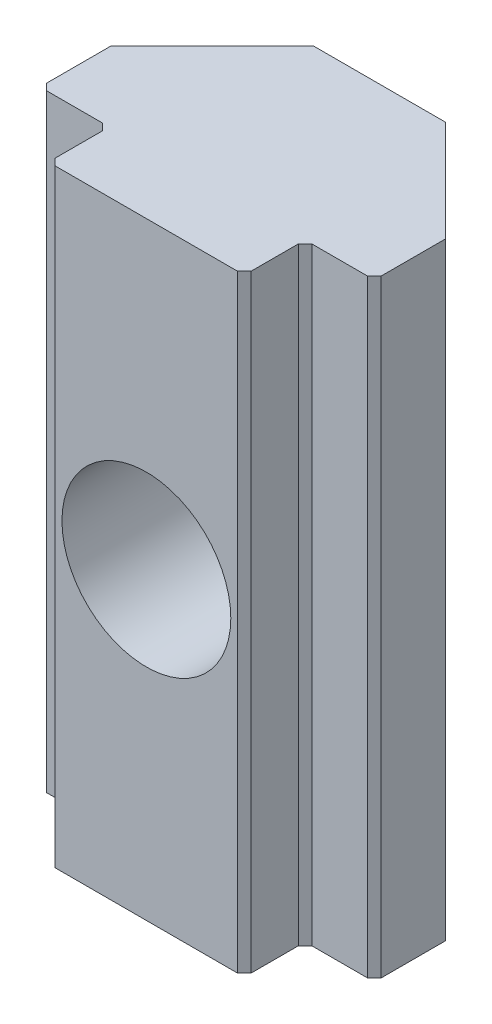
ISO-10303-21;
HEADER;
FILE_DESCRIPTION(('STEP AP214'),'2;1');
FILE_NAME('part.step','',(''),(''),'','','');
FILE_SCHEMA(('AUTOMOTIVE_DESIGN { 1 0 10303 214 1 1 1 1 }'));
ENDSEC;
DATA;
#1=APPLICATION_CONTEXT('core data for automotive mechanical design processes');
#2=APPLICATION_PROTOCOL_DEFINITION('international standard','automotive_design',2000,#1);
#3=PRODUCT_CONTEXT('',#1,'mechanical');
#4=PRODUCT('Part','Part','',(#3));
#5=PRODUCT_RELATED_PRODUCT_CATEGORY('part','',(#4));
#6=PRODUCT_DEFINITION_FORMATION('','',#4);
#7=PRODUCT_DEFINITION_CONTEXT('part definition',#1,'design');
#8=PRODUCT_DEFINITION('design','',#6,#7);
#9=PRODUCT_DEFINITION_SHAPE('','',#8);
#10=(LENGTH_UNIT() NAMED_UNIT(*) SI_UNIT(.MILLI.,.METRE.));
#11=(NAMED_UNIT(*) PLANE_ANGLE_UNIT() SI_UNIT($,.RADIAN.));
#12=(NAMED_UNIT(*) SI_UNIT($,.STERADIAN.) SOLID_ANGLE_UNIT());
#13=UNCERTAINTY_MEASURE_WITH_UNIT(LENGTH_MEASURE(1.E-05),#10,'distance_accuracy_value','');
#14=(GEOMETRIC_REPRESENTATION_CONTEXT(3) GLOBAL_UNCERTAINTY_ASSIGNED_CONTEXT((#13)) GLOBAL_UNIT_ASSIGNED_CONTEXT((#10,
#11,#12)) REPRESENTATION_CONTEXT('',''));
#15=CARTESIAN_POINT('',(0.,0.,0.));
#16=DIRECTION('',(0.,0.,1.));
#17=DIRECTION('',(1.,0.,0.));
#18=AXIS2_PLACEMENT_3D('',#15,#16,#17);
#19=CARTESIAN_POINT('',(-2.9,18.,4.35));
#20=DIRECTION('',(0.,0.,-1.));
#21=DIRECTION('',(-1.,0.,0.));
#22=AXIS2_PLACEMENT_3D('',#19,#20,#21);
#23=PLANE('',#22);
#24=DIRECTION('',(1.,0.,0.));
#25=VECTOR('',#24,1.);
#26=CARTESIAN_POINT('',(-2.9,0.,4.35));
#27=LINE('',#26,#25);
#28=CARTESIAN_POINT('',(-2.7,0.,4.35));
#29=VERTEX_POINT('',#28);
#30=CARTESIAN_POINT('',(2.7,0.,4.35));
#31=VERTEX_POINT('',#30);
#32=EDGE_CURVE('E281',#29,#31,#27,.T.);
#33=ORIENTED_EDGE('',*,*,#32,.T.);
#34=DIRECTION('',(0.,1.,0.));
#35=VECTOR('',#34,1.);
#36=CARTESIAN_POINT('',(2.7,18.,4.35));
#37=LINE('',#36,#35);
#38=CARTESIAN_POINT('',(2.7,18.,4.35));
#39=VERTEX_POINT('',#38);
#40=EDGE_CURVE('E245',#31,#39,#37,.T.);
#41=ORIENTED_EDGE('',*,*,#40,.T.);
#42=DIRECTION('',(1.,0.,0.));
#43=VECTOR('',#42,1.);
#44=CARTESIAN_POINT('',(-2.9,18.,4.35));
#45=LINE('',#44,#43);
#46=CARTESIAN_POINT('',(-2.7,18.,4.35));
#47=VERTEX_POINT('',#46);
#48=EDGE_CURVE('E329',#47,#39,#45,.T.);
#49=ORIENTED_EDGE('',*,*,#48,.F.);
#50=DIRECTION('',(0.,-1.,0.));
#51=VECTOR('',#50,1.);
#52=CARTESIAN_POINT('',(-2.7,18.,4.35));
#53=LINE('',#52,#51);
#54=EDGE_CURVE('E242',#47,#29,#53,.T.);
#55=ORIENTED_EDGE('',*,*,#54,.T.);
#56=EDGE_LOOP('',(#33,#41,#49,#55));
#57=FACE_BOUND('',#56,.T.);
#58=CARTESIAN_POINT('',(0.,9.,4.35));
#59=DIRECTION('',(0.,0.,1.));
#60=DIRECTION('',(1.,0.,0.));
#61=AXIS2_PLACEMENT_3D('',#58,#59,#60);
#62=CIRCLE('',#61,2.49999999999999);
#63=CARTESIAN_POINT('',(2.49999999999999,9.,4.35));
#64=VERTEX_POINT('',#63);
#65=EDGE_CURVE('E348',#64,#64,#62,.T.);
#66=ORIENTED_EDGE('',*,*,#65,.F.);
#67=EDGE_LOOP('',(#66));
#68=FACE_BOUND('',#67,.T.);
#69=ADVANCED_FACE('F42',(#57,#68),#23,.F.);
#70=CARTESIAN_POINT('',(-4.95,18.,-2.55));
#71=DIRECTION('',(0.,0.,1.));
#72=DIRECTION('',(1.,0.,0.));
#73=AXIS2_PLACEMENT_3D('',#70,#71,#72);
#74=PLANE('',#73);
#75=DIRECTION('',(0.,-1.,0.));
#76=VECTOR('',#75,1.);
#77=CARTESIAN_POINT('',(1.95,18.,-2.55));
#78=LINE('',#77,#76);
#79=CARTESIAN_POINT('',(1.95,18.,-2.55));
#80=VERTEX_POINT('',#79);
#81=CARTESIAN_POINT('',(1.95,10.5644487847162,-2.55));
#82=VERTEX_POINT('',#81);
#83=EDGE_CURVE('E184',#80,#82,#78,.T.);
#84=ORIENTED_EDGE('',*,*,#83,.T.);
#85=CARTESIAN_POINT('',(0.,9.,-2.55));
#86=DIRECTION('',(0.,0.,1.));
#87=DIRECTION('',(1.,0.,0.));
#88=AXIS2_PLACEMENT_3D('',#85,#86,#87);
#89=CIRCLE('',#88,2.5);
#90=CARTESIAN_POINT('',(-1.94999999999999,10.5644487847162,-2.55));
#91=VERTEX_POINT('',#90);
#92=EDGE_CURVE('E57',#82,#91,#89,.T.);
#93=ORIENTED_EDGE('',*,*,#92,.T.);
#94=DIRECTION('',(0.,1.,0.));
#95=VECTOR('',#94,1.);
#96=CARTESIAN_POINT('',(-1.94999999999999,18.,-2.55));
#97=LINE('',#96,#95);
#98=CARTESIAN_POINT('',(-1.94999999999999,18.,-2.55));
#99=VERTEX_POINT('',#98);
#100=EDGE_CURVE('E181',#91,#99,#97,.T.);
#101=ORIENTED_EDGE('',*,*,#100,.T.);
#102=DIRECTION('',(-1.,0.,0.));
#103=VECTOR('',#102,1.);
#104=CARTESIAN_POINT('',(-4.95,18.,-2.55));
#105=LINE('',#104,#103);
#106=EDGE_CURVE('E345',#80,#99,#105,.T.);
#107=ORIENTED_EDGE('',*,*,#106,.F.);
#108=EDGE_LOOP('',(#84,#93,#101,#107));
#109=FACE_BOUND('',#108,.T.);
#110=ADVANCED_FACE('F179',(#109),#74,.F.);
#111=CARTESIAN_POINT('',(4.95,18.,2.55));
#112=DIRECTION('',(-1.,0.,0.));
#113=DIRECTION('',(0.,0.,1.));
#114=AXIS2_PLACEMENT_3D('',#111,#112,#113);
#115=PLANE('',#114);
#116=DIRECTION('',(0.,0.,-1.));
#117=VECTOR('',#116,1.);
#118=CARTESIAN_POINT('',(4.95,18.,2.55));
#119=LINE('',#118,#117);
#120=CARTESIAN_POINT('',(4.95,18.,2.35));
#121=VERTEX_POINT('',#120);
#122=CARTESIAN_POINT('',(4.95,18.,0.450000000000006));
#123=VERTEX_POINT('',#122);
#124=EDGE_CURVE('E283',#121,#123,#119,.T.);
#125=ORIENTED_EDGE('',*,*,#124,.F.);
#126=DIRECTION('',(0.,-1.,0.));
#127=VECTOR('',#126,1.);
#128=CARTESIAN_POINT('',(4.95,18.,2.35));
#129=LINE('',#128,#127);
#130=CARTESIAN_POINT('',(4.95,0.,2.35));
#131=VERTEX_POINT('',#130);
#132=EDGE_CURVE('E229',#121,#131,#129,.T.);
#133=ORIENTED_EDGE('',*,*,#132,.T.);
#134=DIRECTION('',(0.,0.,-1.));
#135=VECTOR('',#134,1.);
#136=CARTESIAN_POINT('',(4.95,0.,2.55));
#137=LINE('',#136,#135);
#138=CARTESIAN_POINT('',(4.95,0.,0.450000000000006));
#139=VERTEX_POINT('',#138);
#140=EDGE_CURVE('E175',#131,#139,#137,.T.);
#141=ORIENTED_EDGE('',*,*,#140,.T.);
#142=DIRECTION('',(0.,1.,0.));
#143=VECTOR('',#142,1.);
#144=CARTESIAN_POINT('',(4.95,18.,0.450000000000006));
#145=LINE('',#144,#143);
#146=EDGE_CURVE('E199',#139,#123,#145,.T.);
#147=ORIENTED_EDGE('',*,*,#146,.T.);
#148=EDGE_LOOP('',(#125,#133,#141,#147));
#149=FACE_BOUND('',#148,.T.);
#150=ADVANCED_FACE('F356',(#149),#115,.F.);
#151=CARTESIAN_POINT('',(-1.94999999999999,0.,-2.55));
#152=VERTEX_POINT('',#151);
#153=CARTESIAN_POINT('',(-1.94999999999999,7.43555121528379,-2.55));
#154=VERTEX_POINT('',#153);
#155=EDGE_CURVE('E190',#152,#154,#97,.T.);
#156=ORIENTED_EDGE('',*,*,#155,.T.);
#157=CARTESIAN_POINT('',(1.95,7.43555121528381,-2.55));
#158=VERTEX_POINT('',#157);
#159=EDGE_CURVE('E170',#154,#158,#89,.T.);
#160=ORIENTED_EDGE('',*,*,#159,.T.);
#161=CARTESIAN_POINT('',(1.95,0.,-2.55));
#162=VERTEX_POINT('',#161);
#163=EDGE_CURVE('E193',#158,#162,#78,.T.);
#164=ORIENTED_EDGE('',*,*,#163,.T.);
#165=DIRECTION('',(-1.,0.,0.));
#166=VECTOR('',#165,1.);
#167=CARTESIAN_POINT('',(-4.95,0.,-2.55));
#168=LINE('',#167,#166);
#169=EDGE_CURVE('E302',#162,#152,#168,.T.);
#170=ORIENTED_EDGE('',*,*,#169,.T.);
#171=EDGE_LOOP('',(#156,#160,#164,#170));
#172=FACE_BOUND('',#171,.T.);
#173=ADVANCED_FACE('F301',(#172),#74,.F.);
#174=CARTESIAN_POINT('',(-4.95,18.,2.55));
#175=DIRECTION('',(1.,0.,0.));
#176=DIRECTION('',(0.,0.,-1.));
#177=AXIS2_PLACEMENT_3D('',#174,#175,#176);
#178=PLANE('',#177);
#179=DIRECTION('',(0.,0.,1.));
#180=VECTOR('',#179,1.);
#181=CARTESIAN_POINT('',(-4.95,0.,2.55));
#182=LINE('',#181,#180);
#183=CARTESIAN_POINT('',(-4.95,0.,0.45));
#184=VERTEX_POINT('',#183);
#185=CARTESIAN_POINT('',(-4.95,0.,2.34999999999999));
#186=VERTEX_POINT('',#185);
#187=EDGE_CURVE('E308',#184,#186,#182,.T.);
#188=ORIENTED_EDGE('',*,*,#187,.T.);
#189=DIRECTION('',(0.,1.,0.));
#190=VECTOR('',#189,1.);
#191=CARTESIAN_POINT('',(-4.95,18.,2.34999999999999));
#192=LINE('',#191,#190);
#193=CARTESIAN_POINT('',(-4.95,18.,2.34999999999999));
#194=VERTEX_POINT('',#193);
#195=EDGE_CURVE('E220',#186,#194,#192,.T.);
#196=ORIENTED_EDGE('',*,*,#195,.T.);
#197=DIRECTION('',(0.,0.,1.));
#198=VECTOR('',#197,1.);
#199=CARTESIAN_POINT('',(-4.95,18.,2.55));
#200=LINE('',#199,#198);
#201=CARTESIAN_POINT('',(-4.95,18.,0.45));
#202=VERTEX_POINT('',#201);
#203=EDGE_CURVE('E343',#202,#194,#200,.T.);
#204=ORIENTED_EDGE('',*,*,#203,.F.);
#205=DIRECTION('',(0.,-1.,0.));
#206=VECTOR('',#205,1.);
#207=CARTESIAN_POINT('',(-4.95,18.,0.45));
#208=LINE('',#207,#206);
#209=EDGE_CURVE('E268',#202,#184,#208,.T.);
#210=ORIENTED_EDGE('',*,*,#209,.T.);
#211=EDGE_LOOP('',(#188,#196,#204,#210));
#212=FACE_BOUND('',#211,.T.);
#213=ADVANCED_FACE('F366',(#212),#178,.F.);
#214=CARTESIAN_POINT('',(-4.95,18.,2.55));
#215=DIRECTION('',(0.,0.,-1.));
#216=DIRECTION('',(-1.,0.,0.));
#217=AXIS2_PLACEMENT_3D('',#214,#215,#216);
#218=PLANE('',#217);
#219=DIRECTION('',(1.,0.,0.));
#220=VECTOR('',#219,1.);
#221=CARTESIAN_POINT('',(-4.95,0.,2.55));
#222=LINE('',#221,#220);
#223=CARTESIAN_POINT('',(-4.75,0.,2.55));
#224=VERTEX_POINT('',#223);
#225=CARTESIAN_POINT('',(-3.1,0.,2.55));
#226=VERTEX_POINT('',#225);
#227=EDGE_CURVE('E311',#224,#226,#222,.T.);
#228=ORIENTED_EDGE('',*,*,#227,.T.);
#229=DIRECTION('',(0.,1.,0.));
#230=VECTOR('',#229,1.);
#231=CARTESIAN_POINT('',(-3.1,18.,2.55));
#232=LINE('',#231,#230);
#233=CARTESIAN_POINT('',(-3.1,18.,2.55));
#234=VERTEX_POINT('',#233);
#235=EDGE_CURVE('E210',#226,#234,#232,.T.);
#236=ORIENTED_EDGE('',*,*,#235,.T.);
#237=DIRECTION('',(1.,0.,0.));
#238=VECTOR('',#237,1.);
#239=CARTESIAN_POINT('',(-4.95,18.,2.55));
#240=LINE('',#239,#238);
#241=CARTESIAN_POINT('',(-4.75,18.,2.55));
#242=VERTEX_POINT('',#241);
#243=EDGE_CURVE('E338',#242,#234,#240,.T.);
#244=ORIENTED_EDGE('',*,*,#243,.F.);
#245=DIRECTION('',(0.,-1.,0.));
#246=VECTOR('',#245,1.);
#247=CARTESIAN_POINT('',(-4.75,18.,2.55));
#248=LINE('',#247,#246);
#249=EDGE_CURVE('E207',#242,#224,#248,.T.);
#250=ORIENTED_EDGE('',*,*,#249,.T.);
#251=EDGE_LOOP('',(#228,#236,#244,#250));
#252=FACE_BOUND('',#251,.T.);
#253=ADVANCED_FACE('F363',(#252),#218,.F.);
#254=CARTESIAN_POINT('',(-2.9,18.,4.35));
#255=DIRECTION('',(1.,0.,0.));
#256=DIRECTION('',(0.,0.,-1.));
#257=AXIS2_PLACEMENT_3D('',#254,#255,#256);
#258=PLANE('',#257);
#259=DIRECTION('',(0.,0.,1.));
#260=VECTOR('',#259,1.);
#261=CARTESIAN_POINT('',(-2.9,18.,4.35));
#262=LINE('',#261,#260);
#263=CARTESIAN_POINT('',(-2.9,18.,2.75));
#264=VERTEX_POINT('',#263);
#265=CARTESIAN_POINT('',(-2.9,18.,4.15));
#266=VERTEX_POINT('',#265);
#267=EDGE_CURVE('E331',#264,#266,#262,.T.);
#268=ORIENTED_EDGE('',*,*,#267,.F.);
#269=DIRECTION('',(0.,-1.,0.));
#270=VECTOR('',#269,1.);
#271=CARTESIAN_POINT('',(-2.9,0.,2.75));
#272=LINE('',#271,#270);
#273=CARTESIAN_POINT('',(-2.9,0.,2.75));
#274=VERTEX_POINT('',#273);
#275=EDGE_CURVE('E204',#264,#274,#272,.T.);
#276=ORIENTED_EDGE('',*,*,#275,.T.);
#277=DIRECTION('',(0.,0.,1.));
#278=VECTOR('',#277,1.);
#279=CARTESIAN_POINT('',(-2.9,0.,4.35));
#280=LINE('',#279,#278);
#281=CARTESIAN_POINT('',(-2.9,0.,4.15));
#282=VERTEX_POINT('',#281);
#283=EDGE_CURVE('E286',#274,#282,#280,.T.);
#284=ORIENTED_EDGE('',*,*,#283,.T.);
#285=DIRECTION('',(0.,1.,0.));
#286=VECTOR('',#285,1.);
#287=CARTESIAN_POINT('',(-2.9,18.,4.15));
#288=LINE('',#287,#286);
#289=EDGE_CURVE('E202',#282,#266,#288,.T.);
#290=ORIENTED_EDGE('',*,*,#289,.T.);
#291=EDGE_LOOP('',(#268,#276,#284,#290));
#292=FACE_BOUND('',#291,.T.);
#293=ADVANCED_FACE('F321',(#292),#258,.F.);
#294=CARTESIAN_POINT('',(2.9,18.,4.35));
#295=DIRECTION('',(-1.,0.,0.));
#296=DIRECTION('',(0.,0.,1.));
#297=AXIS2_PLACEMENT_3D('',#294,#295,#296);
#298=PLANE('',#297);
#299=DIRECTION('',(0.,0.,-1.));
#300=VECTOR('',#299,1.);
#301=CARTESIAN_POINT('',(2.9,0.,4.35));
#302=LINE('',#301,#300);
#303=CARTESIAN_POINT('',(2.9,0.,4.15));
#304=VERTEX_POINT('',#303);
#305=CARTESIAN_POINT('',(2.9,0.,2.75));
#306=VERTEX_POINT('',#305);
#307=EDGE_CURVE('E276',#304,#306,#302,.T.);
#308=ORIENTED_EDGE('',*,*,#307,.T.);
#309=DIRECTION('',(0.,1.,0.));
#310=VECTOR('',#309,1.);
#311=CARTESIAN_POINT('',(2.9,18.,2.75));
#312=LINE('',#311,#310);
#313=CARTESIAN_POINT('',(2.9,18.,2.75));
#314=VERTEX_POINT('',#313);
#315=EDGE_CURVE('E240',#306,#314,#312,.T.);
#316=ORIENTED_EDGE('',*,*,#315,.T.);
#317=DIRECTION('',(0.,0.,-1.));
#318=VECTOR('',#317,1.);
#319=CARTESIAN_POINT('',(2.9,18.,4.35));
#320=LINE('',#319,#318);
#321=CARTESIAN_POINT('',(2.9,18.,4.15));
#322=VERTEX_POINT('',#321);
#323=EDGE_CURVE('E259',#322,#314,#320,.T.);
#324=ORIENTED_EDGE('',*,*,#323,.F.);
#325=DIRECTION('',(0.,-1.,0.));
#326=VECTOR('',#325,1.);
#327=CARTESIAN_POINT('',(2.9,18.,4.15));
#328=LINE('',#327,#326);
#329=EDGE_CURVE('E237',#322,#304,#328,.T.);
#330=ORIENTED_EDGE('',*,*,#329,.T.);
#331=EDGE_LOOP('',(#308,#316,#324,#330));
#332=FACE_BOUND('',#331,.T.);
#333=ADVANCED_FACE('F279',(#332),#298,.F.);
#334=CARTESIAN_POINT('',(2.9,18.,2.55));
#335=DIRECTION('',(0.,0.,-1.));
#336=DIRECTION('',(-1.,0.,0.));
#337=AXIS2_PLACEMENT_3D('',#334,#335,#336);
#338=PLANE('',#337);
#339=DIRECTION('',(1.,0.,0.));
#340=VECTOR('',#339,1.);
#341=CARTESIAN_POINT('',(2.9,0.,2.55));
#342=LINE('',#341,#340);
#343=CARTESIAN_POINT('',(3.1,0.,2.55));
#344=VERTEX_POINT('',#343);
#345=CARTESIAN_POINT('',(4.75,0.,2.55));
#346=VERTEX_POINT('',#345);
#347=EDGE_CURVE('E277',#344,#346,#342,.T.);
#348=ORIENTED_EDGE('',*,*,#347,.T.);
#349=DIRECTION('',(0.,1.,0.));
#350=VECTOR('',#349,1.);
#351=CARTESIAN_POINT('',(4.75,18.,2.55));
#352=LINE('',#351,#350);
#353=CARTESIAN_POINT('',(4.75,18.,2.55));
#354=VERTEX_POINT('',#353);
#355=EDGE_CURVE('E235',#346,#354,#352,.T.);
#356=ORIENTED_EDGE('',*,*,#355,.T.);
#357=DIRECTION('',(1.,0.,0.));
#358=VECTOR('',#357,1.);
#359=CARTESIAN_POINT('',(2.9,18.,2.55));
#360=LINE('',#359,#358);
#361=CARTESIAN_POINT('',(3.1,18.,2.55));
#362=VERTEX_POINT('',#361);
#363=EDGE_CURVE('E257',#362,#354,#360,.T.);
#364=ORIENTED_EDGE('',*,*,#363,.F.);
#365=DIRECTION('',(0.,-1.,0.));
#366=VECTOR('',#365,1.);
#367=CARTESIAN_POINT('',(3.1,0.,2.55));
#368=LINE('',#367,#366);
#369=EDGE_CURVE('E232',#362,#344,#368,.T.);
#370=ORIENTED_EDGE('',*,*,#369,.T.);
#371=EDGE_LOOP('',(#348,#356,#364,#370));
#372=FACE_BOUND('',#371,.T.);
#373=ADVANCED_FACE('F265',(#372),#338,.F.);
#374=CARTESIAN_POINT('',(0.,18.,0.));
#375=DIRECTION('',(0.,-1.,0.));
#376=DIRECTION('',(0.,0.,-1.));
#377=AXIS2_PLACEMENT_3D('',#374,#375,#376);
#378=PLANE('',#377);
#379=ORIENTED_EDGE('',*,*,#203,.T.);
#380=DIRECTION('',(-0.707106781186544,0.,-0.707106781186551));
#381=VECTOR('',#380,1.);
#382=CARTESIAN_POINT('',(-4.75,18.,2.55));
#383=LINE('',#382,#381);
#384=EDGE_CURVE('E227',#194,#242,#383,.F.);
#385=ORIENTED_EDGE('',*,*,#384,.T.);
#386=ORIENTED_EDGE('',*,*,#243,.T.);
#387=DIRECTION('',(-0.707106781186544,0.,-0.707106781186551));
#388=VECTOR('',#387,1.);
#389=CARTESIAN_POINT('',(-2.82500000000001,18.,2.82499999999999));
#390=LINE('',#389,#388);
#391=EDGE_CURVE('E249',#234,#264,#390,.F.);
#392=ORIENTED_EDGE('',*,*,#391,.T.);
#393=ORIENTED_EDGE('',*,*,#267,.T.);
#394=DIRECTION('',(-0.707106781186548,0.,-0.707106781186548));
#395=VECTOR('',#394,1.);
#396=CARTESIAN_POINT('',(-2.7,18.,4.35));
#397=LINE('',#396,#395);
#398=EDGE_CURVE('E222',#266,#47,#397,.F.);
#399=ORIENTED_EDGE('',*,*,#398,.T.);
#400=ORIENTED_EDGE('',*,*,#48,.T.);
#401=DIRECTION('',(-0.707106781186551,0.,0.707106781186544));
#402=VECTOR('',#401,1.);
#403=CARTESIAN_POINT('',(2.9,18.,4.15));
#404=LINE('',#403,#402);
#405=EDGE_CURVE('E224',#39,#322,#404,.F.);
#406=ORIENTED_EDGE('',*,*,#405,.T.);
#407=ORIENTED_EDGE('',*,*,#323,.T.);
#408=DIRECTION('',(-0.707106781186551,0.,0.707106781186544));
#409=VECTOR('',#408,1.);
#410=CARTESIAN_POINT('',(2.82499999999999,18.,2.82500000000001));
#411=LINE('',#410,#409);
#412=EDGE_CURVE('E51',#314,#362,#411,.F.);
#413=ORIENTED_EDGE('',*,*,#412,.T.);
#414=ORIENTED_EDGE('',*,*,#363,.T.);
#415=DIRECTION('',(-0.707106781186548,0.,0.707106781186548));
#416=VECTOR('',#415,1.);
#417=CARTESIAN_POINT('',(4.95,18.,2.35));
#418=LINE('',#417,#416);
#419=EDGE_CURVE('E65',#354,#121,#418,.F.);
#420=ORIENTED_EDGE('',*,*,#419,.T.);
#421=ORIENTED_EDGE('',*,*,#124,.T.);
#422=DIRECTION('',(0.707106781186546,0.,0.707106781186549));
#423=VECTOR('',#422,1.);
#424=CARTESIAN_POINT('',(1.95,18.,-2.55));
#425=LINE('',#424,#423);
#426=EDGE_CURVE('E192',#123,#80,#425,.F.);
#427=ORIENTED_EDGE('',*,*,#426,.T.);
#428=ORIENTED_EDGE('',*,*,#106,.T.);
#429=DIRECTION('',(0.707106781186549,0.,-0.707106781186546));
#430=VECTOR('',#429,1.);
#431=CARTESIAN_POINT('',(-4.95,18.,0.45));
#432=LINE('',#431,#430);
#433=EDGE_CURVE('E189',#99,#202,#432,.F.);
#434=ORIENTED_EDGE('',*,*,#433,.T.);
#435=EDGE_LOOP('',(#379,#385,#386,#392,#393,#399,#400,#406,#407,#413,#414,#420,#421,#427,#428,#434));
#436=FACE_BOUND('',#435,.T.);
#437=ADVANCED_FACE('F256',(#436),#378,.F.);
#438=CARTESIAN_POINT('',(0.,0.,0.));
#439=DIRECTION('',(0.,-1.,0.));
#440=DIRECTION('',(0.,0.,-1.));
#441=AXIS2_PLACEMENT_3D('',#438,#439,#440);
#442=PLANE('',#441);
#443=ORIENTED_EDGE('',*,*,#227,.F.);
#444=DIRECTION('',(0.707106781186544,0.,0.707106781186551));
#445=VECTOR('',#444,1.);
#446=CARTESIAN_POINT('',(-3.65000000000002,0.,3.64999999999999));
#447=LINE('',#446,#445);
#448=EDGE_CURVE('E218',#224,#186,#447,.F.);
#449=ORIENTED_EDGE('',*,*,#448,.T.);
#450=ORIENTED_EDGE('',*,*,#187,.F.);
#451=DIRECTION('',(-0.707106781186549,0.,0.707106781186546));
#452=VECTOR('',#451,1.);
#453=CARTESIAN_POINT('',(-2.24999999999999,0.,-2.25));
#454=LINE('',#453,#452);
#455=EDGE_CURVE('E294',#184,#152,#454,.F.);
#456=ORIENTED_EDGE('',*,*,#455,.T.);
#457=ORIENTED_EDGE('',*,*,#169,.F.);
#458=DIRECTION('',(-0.707106781186546,0.,-0.707106781186549));
#459=VECTOR('',#458,1.);
#460=CARTESIAN_POINT('',(2.25000000000001,0.,-2.25));
#461=LINE('',#460,#459);
#462=EDGE_CURVE('E292',#162,#139,#461,.F.);
#463=ORIENTED_EDGE('',*,*,#462,.T.);
#464=ORIENTED_EDGE('',*,*,#140,.F.);
#465=DIRECTION('',(0.707106781186548,0.,-0.707106781186548));
#466=VECTOR('',#465,1.);
#467=CARTESIAN_POINT('',(3.65,0.,3.65));
#468=LINE('',#467,#466);
#469=EDGE_CURVE('E216',#131,#346,#468,.F.);
#470=ORIENTED_EDGE('',*,*,#469,.T.);
#471=ORIENTED_EDGE('',*,*,#347,.F.);
#472=DIRECTION('',(0.707106781186551,0.,-0.707106781186544));
#473=VECTOR('',#472,1.);
#474=CARTESIAN_POINT('',(3.1,0.,2.55));
#475=LINE('',#474,#473);
#476=EDGE_CURVE('E251',#344,#306,#475,.F.);
#477=ORIENTED_EDGE('',*,*,#476,.T.);
#478=ORIENTED_EDGE('',*,*,#307,.F.);
#479=DIRECTION('',(0.707106781186551,0.,-0.707106781186544));
#480=VECTOR('',#479,1.);
#481=CARTESIAN_POINT('',(3.52499999999999,0.,3.52500000000002));
#482=LINE('',#481,#480);
#483=EDGE_CURVE('E214',#304,#31,#482,.F.);
#484=ORIENTED_EDGE('',*,*,#483,.T.);
#485=ORIENTED_EDGE('',*,*,#32,.F.);
#486=DIRECTION('',(0.707106781186548,0.,0.707106781186548));
#487=VECTOR('',#486,1.);
#488=CARTESIAN_POINT('',(-3.525,0.,3.525));
#489=LINE('',#488,#487);
#490=EDGE_CURVE('E212',#29,#282,#489,.F.);
#491=ORIENTED_EDGE('',*,*,#490,.T.);
#492=ORIENTED_EDGE('',*,*,#283,.F.);
#493=DIRECTION('',(0.707106781186544,0.,0.707106781186551));
#494=VECTOR('',#493,1.);
#495=CARTESIAN_POINT('',(-2.9,0.,2.75));
#496=LINE('',#495,#494);
#497=EDGE_CURVE('E247',#274,#226,#496,.F.);
#498=ORIENTED_EDGE('',*,*,#497,.T.);
#499=EDGE_LOOP('',(#443,#449,#450,#456,#457,#463,#464,#470,#471,#477,#478,#484,#485,#491,#492,#498));
#500=FACE_BOUND('',#499,.T.);
#501=ADVANCED_FACE('F275',(#500),#442,.T.);
#502=CARTESIAN_POINT('',(-4.95,18.,0.45));
#503=DIRECTION('',(0.707106781186546,0.,0.707106781186549));
#504=DIRECTION('',(0.,-1.,0.));
#505=AXIS2_PLACEMENT_3D('',#502,#503,#504);
#506=PLANE('',#505);
#507=CARTESIAN_POINT('',(0.,9.,-4.49999999999998));
#508=DIRECTION('',(0.707106781186546,0.,0.707106781186549));
#509=DIRECTION('',(-0.707106781186549,0.,0.707106781186546));
#510=AXIS2_PLACEMENT_3D('',#507,#508,#509);
#511=ELLIPSE('',#510,3.53553390593272,2.49999999999999);
#512=EDGE_CURVE('E166',#154,#91,#511,.F.);
#513=ORIENTED_EDGE('',*,*,#512,.F.);
#514=ORIENTED_EDGE('',*,*,#155,.F.);
#515=ORIENTED_EDGE('',*,*,#455,.F.);
#516=ORIENTED_EDGE('',*,*,#209,.F.);
#517=ORIENTED_EDGE('',*,*,#433,.F.);
#518=ORIENTED_EDGE('',*,*,#100,.F.);
#519=EDGE_LOOP('',(#513,#514,#515,#516,#517,#518));
#520=FACE_BOUND('',#519,.T.);
#521=ADVANCED_FACE('F187',(#520),#506,.F.);
#522=CARTESIAN_POINT('',(1.95,18.,-2.55));
#523=DIRECTION('',(-0.707106781186549,0.,0.707106781186546));
#524=DIRECTION('',(0.,-1.,0.));
#525=AXIS2_PLACEMENT_3D('',#522,#523,#524);
#526=PLANE('',#525);
#527=CARTESIAN_POINT('',(0.,9.,-4.50000000000001));
#528=DIRECTION('',(-0.707106781186549,0.,0.707106781186546));
#529=DIRECTION('',(0.707106781186546,0.,0.707106781186549));
#530=AXIS2_PLACEMENT_3D('',#527,#528,#529);
#531=ELLIPSE('',#530,3.53553390593274,2.49999999999999);
#532=EDGE_CURVE('E11',#82,#158,#531,.F.);
#533=ORIENTED_EDGE('',*,*,#532,.F.);
#534=ORIENTED_EDGE('',*,*,#83,.F.);
#535=ORIENTED_EDGE('',*,*,#426,.F.);
#536=ORIENTED_EDGE('',*,*,#146,.F.);
#537=ORIENTED_EDGE('',*,*,#462,.F.);
#538=ORIENTED_EDGE('',*,*,#163,.F.);
#539=EDGE_LOOP('',(#533,#534,#535,#536,#537,#538));
#540=FACE_BOUND('',#539,.T.);
#541=ADVANCED_FACE('F305',(#540),#526,.F.);
#542=CARTESIAN_POINT('',(-2.9,18.,2.75));
#543=DIRECTION('',(-0.707106781186551,0.,0.707106781186544));
#544=DIRECTION('',(0.,1.,0.));
#545=AXIS2_PLACEMENT_3D('',#542,#543,#544);
#546=PLANE('',#545);
#547=ORIENTED_EDGE('',*,*,#391,.F.);
#548=ORIENTED_EDGE('',*,*,#235,.F.);
#549=ORIENTED_EDGE('',*,*,#497,.F.);
#550=ORIENTED_EDGE('',*,*,#275,.F.);
#551=EDGE_LOOP('',(#547,#548,#549,#550));
#552=FACE_BOUND('',#551,.T.);
#553=ADVANCED_FACE('F386',(#552),#546,.T.);
#554=CARTESIAN_POINT('',(-4.75,18.,2.55));
#555=DIRECTION('',(0.707106781186551,0.,-0.707106781186544));
#556=DIRECTION('',(0.,-1.,0.));
#557=AXIS2_PLACEMENT_3D('',#554,#555,#556);
#558=PLANE('',#557);
#559=ORIENTED_EDGE('',*,*,#384,.F.);
#560=ORIENTED_EDGE('',*,*,#195,.F.);
#561=ORIENTED_EDGE('',*,*,#448,.F.);
#562=ORIENTED_EDGE('',*,*,#249,.F.);
#563=EDGE_LOOP('',(#559,#560,#561,#562));
#564=FACE_BOUND('',#563,.T.);
#565=ADVANCED_FACE('F392',(#564),#558,.F.);
#566=CARTESIAN_POINT('',(4.95,18.,2.35));
#567=DIRECTION('',(-0.707106781186547,0.,-0.707106781186547));
#568=DIRECTION('',(0.,-1.,0.));
#569=AXIS2_PLACEMENT_3D('',#566,#567,#568);
#570=PLANE('',#569);
#571=ORIENTED_EDGE('',*,*,#419,.F.);
#572=ORIENTED_EDGE('',*,*,#355,.F.);
#573=ORIENTED_EDGE('',*,*,#469,.F.);
#574=ORIENTED_EDGE('',*,*,#132,.F.);
#575=EDGE_LOOP('',(#571,#572,#573,#574));
#576=FACE_BOUND('',#575,.T.);
#577=ADVANCED_FACE('F399',(#576),#570,.F.);
#578=CARTESIAN_POINT('',(3.1,18.,2.55));
#579=DIRECTION('',(0.707106781186544,0.,0.707106781186551));
#580=DIRECTION('',(0.,1.,0.));
#581=AXIS2_PLACEMENT_3D('',#578,#579,#580);
#582=PLANE('',#581);
#583=ORIENTED_EDGE('',*,*,#412,.F.);
#584=ORIENTED_EDGE('',*,*,#315,.F.);
#585=ORIENTED_EDGE('',*,*,#476,.F.);
#586=ORIENTED_EDGE('',*,*,#369,.F.);
#587=EDGE_LOOP('',(#583,#584,#585,#586));
#588=FACE_BOUND('',#587,.T.);
#589=ADVANCED_FACE('F270',(#588),#582,.T.);
#590=CARTESIAN_POINT('',(2.9,18.,4.15));
#591=DIRECTION('',(-0.707106781186544,0.,-0.707106781186551));
#592=DIRECTION('',(0.,-1.,0.));
#593=AXIS2_PLACEMENT_3D('',#590,#591,#592);
#594=PLANE('',#593);
#595=ORIENTED_EDGE('',*,*,#405,.F.);
#596=ORIENTED_EDGE('',*,*,#40,.F.);
#597=ORIENTED_EDGE('',*,*,#483,.F.);
#598=ORIENTED_EDGE('',*,*,#329,.F.);
#599=EDGE_LOOP('',(#595,#596,#597,#598));
#600=FACE_BOUND('',#599,.T.);
#601=ADVANCED_FACE('F411',(#600),#594,.F.);
#602=CARTESIAN_POINT('',(-2.7,18.,4.35));
#603=DIRECTION('',(0.707106781186547,0.,-0.707106781186547));
#604=DIRECTION('',(0.,-1.,0.));
#605=AXIS2_PLACEMENT_3D('',#602,#603,#604);
#606=PLANE('',#605);
#607=ORIENTED_EDGE('',*,*,#398,.F.);
#608=ORIENTED_EDGE('',*,*,#289,.F.);
#609=ORIENTED_EDGE('',*,*,#490,.F.);
#610=ORIENTED_EDGE('',*,*,#54,.F.);
#611=EDGE_LOOP('',(#607,#608,#609,#610));
#612=FACE_BOUND('',#611,.T.);
#613=ADVANCED_FACE('F45',(#612),#606,.F.);
#614=CARTESIAN_POINT('',(0.,9.,4.35));
#615=DIRECTION('',(0.,0.,1.));
#616=DIRECTION('',(1.,0.,0.));
#617=AXIS2_PLACEMENT_3D('',#614,#615,#616);
#618=CYLINDRICAL_SURFACE('',#617,2.49999999999999);
#619=ORIENTED_EDGE('',*,*,#512,.T.);
#620=ORIENTED_EDGE('',*,*,#92,.F.);
#621=ORIENTED_EDGE('',*,*,#532,.T.);
#622=ORIENTED_EDGE('',*,*,#159,.F.);
#623=EDGE_LOOP('',(#619,#620,#621,#622));
#624=FACE_BOUND('',#623,.T.);
#625=ORIENTED_EDGE('',*,*,#65,.T.);
#626=EDGE_LOOP('',(#625));
#627=FACE_BOUND('',#626,.T.);
#628=ADVANCED_FACE('F167',(#624,#627),#618,.F.);
#629=CLOSED_SHELL('',(#69,#110,#150,#173,#213,#253,#293,#333,#373,#437,#501,#521,#541,#553,#565,
#577,#589,#601,#613,#628));
#630=MANIFOLD_SOLID_BREP('B2',#629);
#631=ADVANCED_BREP_SHAPE_REPRESENTATION('',(#18,#630),#14);
#632=SHAPE_DEFINITION_REPRESENTATION(#9,#631);
ENDSEC;
END-ISO-10303-21;
